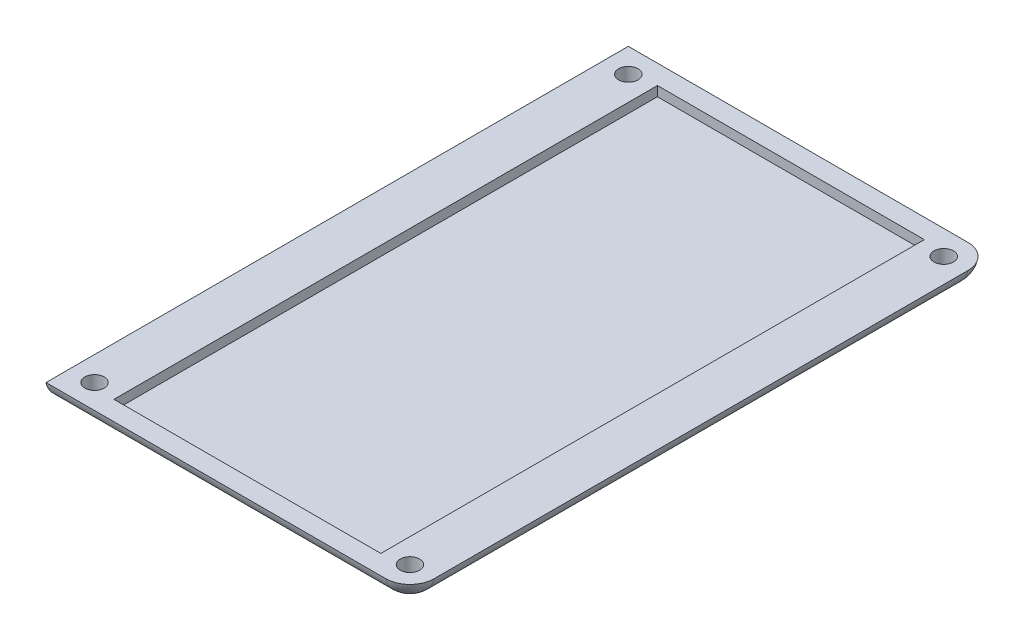
ISO-10303-21;
HEADER;
FILE_DESCRIPTION(('STEP AP214'),'2;1');
FILE_NAME('part.step','',(''),(''),'','','');
FILE_SCHEMA(('AUTOMOTIVE_DESIGN { 1 0 10303 214 1 1 1 1 }'));
ENDSEC;
DATA;
#1=APPLICATION_CONTEXT('core data for automotive mechanical design processes');
#2=APPLICATION_PROTOCOL_DEFINITION('international standard','automotive_design',2000,#1);
#3=PRODUCT_CONTEXT('',#1,'mechanical');
#4=PRODUCT('Part','Part','',(#3));
#5=PRODUCT_RELATED_PRODUCT_CATEGORY('part','',(#4));
#6=PRODUCT_DEFINITION_FORMATION('','',#4);
#7=PRODUCT_DEFINITION_CONTEXT('part definition',#1,'design');
#8=PRODUCT_DEFINITION('design','',#6,#7);
#9=PRODUCT_DEFINITION_SHAPE('','',#8);
#10=(LENGTH_UNIT() NAMED_UNIT(*) SI_UNIT(.MILLI.,.METRE.));
#11=(NAMED_UNIT(*) PLANE_ANGLE_UNIT() SI_UNIT($,.RADIAN.));
#12=(NAMED_UNIT(*) SI_UNIT($,.STERADIAN.) SOLID_ANGLE_UNIT());
#13=UNCERTAINTY_MEASURE_WITH_UNIT(LENGTH_MEASURE(1.E-05),#10,'distance_accuracy_value','');
#14=(GEOMETRIC_REPRESENTATION_CONTEXT(3) GLOBAL_UNCERTAINTY_ASSIGNED_CONTEXT((#13)) GLOBAL_UNIT_ASSIGNED_CONTEXT((#10,
#11,#12)) REPRESENTATION_CONTEXT('',''));
#15=CARTESIAN_POINT('',(0.,0.,0.));
#16=DIRECTION('',(0.,0.,1.));
#17=DIRECTION('',(1.,0.,0.));
#18=AXIS2_PLACEMENT_3D('',#15,#16,#17);
#19=CARTESIAN_POINT('',(0.,2.,0.));
#20=DIRECTION('',(1.,0.,0.));
#21=DIRECTION('',(0.,0.,-1.));
#22=AXIS2_PLACEMENT_3D('',#19,#20,#21);
#23=PLANE('',#22);
#24=DIRECTION('',(0.,0.,1.));
#25=VECTOR('',#24,1.);
#26=CARTESIAN_POINT('',(0.,0.,0.));
#27=LINE('',#26,#25);
#28=CARTESIAN_POINT('',(0.,0.,-57.5505102572168));
#29=VERTEX_POINT('',#28);
#30=CARTESIAN_POINT('',(0.,0.,-2.44948974278318));
#31=VERTEX_POINT('',#30);
#32=EDGE_CURVE('E198',#29,#31,#27,.T.);
#33=ORIENTED_EDGE('',*,*,#32,.T.);
#34=CARTESIAN_POINT('',(0.,2.5,-2.44948974278318));
#35=DIRECTION('',(1.,0.,0.));
#36=DIRECTION('',(0.,0.,-1.));
#37=AXIS2_PLACEMENT_3D('',#34,#35,#36);
#38=CIRCLE('',#37,2.5);
#39=CARTESIAN_POINT('',(0.,2.,0.));
#40=VERTEX_POINT('',#39);
#41=EDGE_CURVE('E272',#31,#40,#38,.F.);
#42=ORIENTED_EDGE('',*,*,#41,.T.);
#43=DIRECTION('',(0.,0.,1.));
#44=VECTOR('',#43,1.);
#45=CARTESIAN_POINT('',(0.,2.,0.));
#46=LINE('',#45,#44);
#47=CARTESIAN_POINT('',(0.,2.,-60.));
#48=VERTEX_POINT('',#47);
#49=EDGE_CURVE('E201',#48,#40,#46,.T.);
#50=ORIENTED_EDGE('',*,*,#49,.F.);
#51=CARTESIAN_POINT('',(0.,2.5,-57.5505102572168));
#52=DIRECTION('',(1.,0.,0.));
#53=DIRECTION('',(0.,0.,-1.));
#54=AXIS2_PLACEMENT_3D('',#51,#52,#53);
#55=CIRCLE('',#54,2.5);
#56=EDGE_CURVE('E268',#48,#29,#55,.F.);
#57=ORIENTED_EDGE('',*,*,#56,.T.);
#58=EDGE_LOOP('',(#33,#42,#50,#57));
#59=FACE_BOUND('',#58,.T.);
#60=ADVANCED_FACE('F33',(#59),#23,.F.);
#61=CARTESIAN_POINT('',(0.,2.,0.));
#62=DIRECTION('',(0.,-1.,0.));
#63=DIRECTION('',(0.,0.,-1.));
#64=AXIS2_PLACEMENT_3D('',#61,#62,#63);
#65=PLANE('',#64);
#66=DIRECTION('',(1.,0.,0.));
#67=VECTOR('',#66,1.);
#68=CARTESIAN_POINT('',(5.00000000000001,2.,-2.));
#69=LINE('',#68,#67);
#70=CARTESIAN_POINT('',(5.00000000000001,2.,-2.));
#71=VERTEX_POINT('',#70);
#72=CARTESIAN_POINT('',(32.5,2.,-2.));
#73=VERTEX_POINT('',#72);
#74=EDGE_CURVE('E167',#71,#73,#69,.T.);
#75=ORIENTED_EDGE('',*,*,#74,.F.);
#76=DIRECTION('',(0.,0.,1.));
#77=VECTOR('',#76,1.);
#78=CARTESIAN_POINT('',(5.,2.,-58.));
#79=LINE('',#78,#77);
#80=CARTESIAN_POINT('',(5.,2.,-58.));
#81=VERTEX_POINT('',#80);
#82=EDGE_CURVE('E141',#81,#71,#79,.T.);
#83=ORIENTED_EDGE('',*,*,#82,.F.);
#84=DIRECTION('',(-1.,0.,0.));
#85=VECTOR('',#84,1.);
#86=CARTESIAN_POINT('',(5.,2.,-58.));
#87=LINE('',#86,#85);
#88=CARTESIAN_POINT('',(32.5,2.,-58.));
#89=VERTEX_POINT('',#88);
#90=EDGE_CURVE('E158',#89,#81,#87,.T.);
#91=ORIENTED_EDGE('',*,*,#90,.F.);
#92=DIRECTION('',(0.,0.,-1.));
#93=VECTOR('',#92,1.);
#94=CARTESIAN_POINT('',(32.5,2.,-58.));
#95=LINE('',#94,#93);
#96=EDGE_CURVE('E161',#73,#89,#95,.T.);
#97=ORIENTED_EDGE('',*,*,#96,.F.);
#98=EDGE_LOOP('',(#75,#83,#91,#97));
#99=FACE_BOUND('',#98,.T.);
#100=CARTESIAN_POINT('',(2.5,2.,-2.5));
#101=DIRECTION('',(0.,1.,0.));
#102=DIRECTION('',(0.,0.,1.));
#103=AXIS2_PLACEMENT_3D('',#100,#101,#102);
#104=CIRCLE('',#103,1.);
#105=CARTESIAN_POINT('',(2.5,2.,-1.5));
#106=VERTEX_POINT('',#105);
#107=EDGE_CURVE('E173',#106,#106,#104,.T.);
#108=ORIENTED_EDGE('',*,*,#107,.F.);
#109=EDGE_LOOP('',(#108));
#110=FACE_BOUND('',#109,.T.);
#111=CARTESIAN_POINT('',(35.,2.,-2.5));
#112=DIRECTION('',(0.,1.,0.));
#113=DIRECTION('',(0.,0.,1.));
#114=AXIS2_PLACEMENT_3D('',#111,#112,#113);
#115=CIRCLE('',#114,0.999999999999998);
#116=CARTESIAN_POINT('',(35.,2.,-1.5));
#117=VERTEX_POINT('',#116);
#118=EDGE_CURVE('E187',#117,#117,#115,.T.);
#119=ORIENTED_EDGE('',*,*,#118,.F.);
#120=EDGE_LOOP('',(#119));
#121=FACE_BOUND('',#120,.T.);
#122=CARTESIAN_POINT('',(35.,2.,-57.5));
#123=DIRECTION('',(0.,1.,0.));
#124=DIRECTION('',(0.,0.,1.));
#125=AXIS2_PLACEMENT_3D('',#122,#123,#124);
#126=CIRCLE('',#125,0.999999999999998);
#127=CARTESIAN_POINT('',(35.,2.,-56.5));
#128=VERTEX_POINT('',#127);
#129=EDGE_CURVE('E181',#128,#128,#126,.T.);
#130=ORIENTED_EDGE('',*,*,#129,.F.);
#131=EDGE_LOOP('',(#130));
#132=FACE_BOUND('',#131,.T.);
#133=CARTESIAN_POINT('',(2.5,2.,-57.5));
#134=DIRECTION('',(0.,1.,0.));
#135=DIRECTION('',(0.,0.,1.));
#136=AXIS2_PLACEMENT_3D('',#133,#134,#135);
#137=CIRCLE('',#136,1.);
#138=CARTESIAN_POINT('',(2.5,2.,-56.5));
#139=VERTEX_POINT('',#138);
#140=EDGE_CURVE('E180',#139,#139,#137,.T.);
#141=ORIENTED_EDGE('',*,*,#140,.F.);
#142=EDGE_LOOP('',(#141));
#143=FACE_BOUND('',#142,.T.);
#144=DIRECTION('',(1.,0.,0.));
#145=VECTOR('',#144,1.);
#146=CARTESIAN_POINT('',(0.,2.,0.));
#147=LINE('',#146,#145);
#148=CARTESIAN_POINT('',(35.,2.,0.));
#149=VERTEX_POINT('',#148);
#150=EDGE_CURVE('E204',#40,#149,#147,.T.);
#151=ORIENTED_EDGE('',*,*,#150,.T.);
#152=CARTESIAN_POINT('',(35.,2.,-2.5));
#153=DIRECTION('',(0.,-1.,0.));
#154=DIRECTION('',(0.,0.,-1.));
#155=AXIS2_PLACEMENT_3D('',#152,#153,#154);
#156=CIRCLE('',#155,2.5);
#157=CARTESIAN_POINT('',(37.5,2.,-2.5));
#158=VERTEX_POINT('',#157);
#159=EDGE_CURVE('E215',#149,#158,#156,.F.);
#160=ORIENTED_EDGE('',*,*,#159,.T.);
#161=DIRECTION('',(0.,0.,-1.));
#162=VECTOR('',#161,1.);
#163=CARTESIAN_POINT('',(37.5,2.,0.));
#164=LINE('',#163,#162);
#165=CARTESIAN_POINT('',(37.5,2.,-57.5));
#166=VERTEX_POINT('',#165);
#167=EDGE_CURVE('E207',#158,#166,#164,.T.);
#168=ORIENTED_EDGE('',*,*,#167,.T.);
#169=CARTESIAN_POINT('',(35.,2.,-57.5));
#170=DIRECTION('',(0.,-1.,0.));
#171=DIRECTION('',(0.,0.,-1.));
#172=AXIS2_PLACEMENT_3D('',#169,#170,#171);
#173=CIRCLE('',#172,2.5);
#174=CARTESIAN_POINT('',(35.,2.,-60.));
#175=VERTEX_POINT('',#174);
#176=EDGE_CURVE('E211',#166,#175,#173,.F.);
#177=ORIENTED_EDGE('',*,*,#176,.T.);
#178=DIRECTION('',(-1.,0.,0.));
#179=VECTOR('',#178,1.);
#180=CARTESIAN_POINT('',(0.,2.,-60.));
#181=LINE('',#180,#179);
#182=EDGE_CURVE('E209',#175,#48,#181,.T.);
#183=ORIENTED_EDGE('',*,*,#182,.T.);
#184=ORIENTED_EDGE('',*,*,#49,.T.);
#185=EDGE_LOOP('',(#151,#160,#168,#177,#183,#184));
#186=FACE_BOUND('',#185,.T.);
#187=ADVANCED_FACE('F292',(#99,#110,#121,#132,#143,#186),#65,.F.);
#188=CARTESIAN_POINT('',(0.,0.,0.));
#189=DIRECTION('',(0.,-1.,0.));
#190=DIRECTION('',(0.,0.,-1.));
#191=AXIS2_PLACEMENT_3D('',#188,#189,#190);
#192=PLANE('',#191);
#193=CARTESIAN_POINT('',(35.,0.,-2.5));
#194=DIRECTION('',(0.,1.,0.));
#195=DIRECTION('',(0.,0.,1.));
#196=AXIS2_PLACEMENT_3D('',#193,#194,#195);
#197=CIRCLE('',#196,0.999999999999998);
#198=CARTESIAN_POINT('',(35.0505102572168,0.,-3.4987235422858));
#199=VERTEX_POINT('',#198);
#200=CARTESIAN_POINT('',(34.0012764577142,0.,-2.44948974278318));
#201=VERTEX_POINT('',#200);
#202=EDGE_CURVE('E184',#199,#201,#197,.T.);
#203=ORIENTED_EDGE('',*,*,#202,.T.);
#204=DIRECTION('',(1.,0.,0.));
#205=VECTOR('',#204,1.);
#206=CARTESIAN_POINT('',(0.,0.,-2.44948974278318));
#207=LINE('',#206,#205);
#208=CARTESIAN_POINT('',(3.4987235422858,0.,-2.44948974278318));
#209=VERTEX_POINT('',#208);
#210=EDGE_CURVE('E269',#201,#209,#207,.F.);
#211=ORIENTED_EDGE('',*,*,#210,.T.);
#212=CARTESIAN_POINT('',(2.5,0.,-2.5));
#213=DIRECTION('',(0.,1.,0.));
#214=DIRECTION('',(0.,0.,1.));
#215=AXIS2_PLACEMENT_3D('',#212,#213,#214);
#216=CIRCLE('',#215,1.);
#217=CARTESIAN_POINT('',(1.5012764577142,0.,-2.44948974278318));
#218=VERTEX_POINT('',#217);
#219=EDGE_CURVE('E190',#209,#218,#216,.T.);
#220=ORIENTED_EDGE('',*,*,#219,.T.);
#221=DIRECTION('',(1.,0.,0.));
#222=VECTOR('',#221,1.);
#223=CARTESIAN_POINT('',(0.,0.,-2.44948974278318));
#224=LINE('',#223,#222);
#225=EDGE_CURVE('E312',#218,#31,#224,.F.);
#226=ORIENTED_EDGE('',*,*,#225,.T.);
#227=ORIENTED_EDGE('',*,*,#32,.F.);
#228=DIRECTION('',(-1.,0.,0.));
#229=VECTOR('',#228,1.);
#230=CARTESIAN_POINT('',(35.,0.,-57.5505102572168));
#231=LINE('',#230,#229);
#232=CARTESIAN_POINT('',(1.5012764577142,0.,-57.5505102572168));
#233=VERTEX_POINT('',#232);
#234=EDGE_CURVE('E323',#29,#233,#231,.F.);
#235=ORIENTED_EDGE('',*,*,#234,.T.);
#236=CARTESIAN_POINT('',(2.5,0.,-57.5));
#237=DIRECTION('',(0.,1.,0.));
#238=DIRECTION('',(0.,0.,1.));
#239=AXIS2_PLACEMENT_3D('',#236,#237,#238);
#240=CIRCLE('',#239,1.);
#241=CARTESIAN_POINT('',(3.4987235422858,0.,-57.5505102572168));
#242=VERTEX_POINT('',#241);
#243=EDGE_CURVE('E195',#233,#242,#240,.T.);
#244=ORIENTED_EDGE('',*,*,#243,.T.);
#245=DIRECTION('',(-1.,0.,0.));
#246=VECTOR('',#245,1.);
#247=CARTESIAN_POINT('',(35.,0.,-57.5505102572168));
#248=LINE('',#247,#246);
#249=CARTESIAN_POINT('',(34.0012764577142,0.,-57.5505102572168));
#250=VERTEX_POINT('',#249);
#251=EDGE_CURVE('E326',#242,#250,#248,.F.);
#252=ORIENTED_EDGE('',*,*,#251,.T.);
#253=CARTESIAN_POINT('',(35.,0.,-57.5));
#254=DIRECTION('',(0.,1.,0.));
#255=DIRECTION('',(0.,0.,1.));
#256=AXIS2_PLACEMENT_3D('',#253,#254,#255);
#257=CIRCLE('',#256,0.999999999999998);
#258=CARTESIAN_POINT('',(35.0505102572168,0.,-56.5012764577142));
#259=VERTEX_POINT('',#258);
#260=EDGE_CURVE('E177',#250,#259,#257,.T.);
#261=ORIENTED_EDGE('',*,*,#260,.T.);
#262=DIRECTION('',(0.,0.,-1.));
#263=VECTOR('',#262,1.);
#264=CARTESIAN_POINT('',(35.0505102572168,0.,-2.5));
#265=LINE('',#264,#263);
#266=EDGE_CURVE('E250',#259,#199,#265,.F.);
#267=ORIENTED_EDGE('',*,*,#266,.T.);
#268=EDGE_LOOP('',(#203,#211,#220,#226,#227,#235,#244,#252,#261,#267));
#269=FACE_BOUND('',#268,.T.);
#270=ADVANCED_FACE('F290',(#269),#192,.T.);
#271=CARTESIAN_POINT('',(2.5,0.,-57.5));
#272=DIRECTION('',(0.,1.,0.));
#273=DIRECTION('',(0.,0.,1.));
#274=AXIS2_PLACEMENT_3D('',#271,#272,#273);
#275=CYLINDRICAL_SURFACE('',#274,1.);
#276=ORIENTED_EDGE('',*,*,#243,.F.);
#277=CARTESIAN_POINT('',(1.5012764577142,0.,-57.5505102572168));
#278=CARTESIAN_POINT('',(1.50264405103061,-2.33867517916646E-06,-57.5775696890232));
#279=CARTESIAN_POINT('',(1.50511321347047,0.000439812273468856,-57.604559137011));
#280=CARTESIAN_POINT('',(1.5122243588701,0.00217726214721237,-57.6582139549573));
#281=CARTESIAN_POINT('',(1.51686564895951,0.00347228907353855,-57.684879425478));
#282=CARTESIAN_POINT('',(1.53395602142734,0.00856891273167531,-57.7639149393168));
#283=CARTESIAN_POINT('',(1.54958381992474,0.0135826689881734,-57.815557246347));
#284=CARTESIAN_POINT('',(1.58874160063682,0.0262467316347284,-57.9153105617559));
#285=CARTESIAN_POINT('',(1.61226554541273,0.0338950237602736,-57.9634242340044));
#286=CARTESIAN_POINT('',(1.6665067107986,0.0510056023855132,-58.0550918710336));
#287=CARTESIAN_POINT('',(1.6972292848779,0.0604692379635587,-58.0986424072526));
#288=CARTESIAN_POINT('',(1.76651267404628,0.0806611391987383,-58.1819497876315));
#289=CARTESIAN_POINT('',(1.8053510851303,0.0914260547196431,-58.2214667892024));
#290=CARTESIAN_POINT('',(1.88905910225778,0.112693859589415,-58.2936025958969));
#291=CARTESIAN_POINT('',(1.93393041329925,0.123196673865595,-58.3262194441914));
#292=CARTESIAN_POINT('',(2.03033494452181,0.143071658891476,-58.3847034912981));
#293=CARTESIAN_POINT('',(2.08204459013178,0.152392322691949,-58.4102990109523));
#294=CARTESIAN_POINT('',(2.1894678908045,0.168204722239597,-58.4523082850072));
#295=CARTESIAN_POINT('',(2.24517935815632,0.174697990157419,-58.4687270136981));
#296=CARTESIAN_POINT('',(2.35606494412164,0.18366842159323,-58.4911205114653));
#297=CARTESIAN_POINT('',(2.41112660135217,0.186330190700132,-58.4975765193841));
#298=CARTESIAN_POINT('',(2.52160427875832,0.187853836380068,-58.5012918771889));
#299=CARTESIAN_POINT('',(2.57702018579643,0.186716871033467,-58.4985540299078));
#300=CARTESIAN_POINT('',(2.68343125593536,0.180976667075142,-58.4844169352516));
#301=CARTESIAN_POINT('',(2.73450234364879,0.17656661172096,-58.4735000980935));
#302=CARTESIAN_POINT('',(2.83405101899508,0.165058313288944,-58.4439844714306));
#303=CARTESIAN_POINT('',(2.88252807700792,0.157959523627276,-58.4253841199001));
#304=CARTESIAN_POINT('',(2.97730922040125,0.14162078319076,-58.3803519541813));
#305=CARTESIAN_POINT('',(3.02348909786234,0.132317995561402,-58.3536823162894));
#306=CARTESIAN_POINT('',(3.1109081403264,0.11274285988141,-58.2934797604795));
#307=CARTESIAN_POINT('',(3.15214574268316,0.102470207004991,-58.2599446808782));
#308=CARTESIAN_POINT('',(3.23137592450108,0.0813362654987416,-58.1843129658374));
#309=CARTESIAN_POINT('',(3.26896909652313,0.0704813723528512,-58.1417947010422));
#310=CARTESIAN_POINT('',(3.33657415075004,0.050121872570814,-58.0507785169673));
#311=CARTESIAN_POINT('',(3.36658285516127,0.0406178326521034,-58.0022781038673));
#312=CARTESIAN_POINT('',(3.41803192545553,0.0240950580371556,-57.9005785210998));
#313=CARTESIAN_POINT('',(3.43947983557512,0.0170741357073795,-57.847383539256));
#314=CARTESIAN_POINT('',(3.47297005924028,0.00643039932496516,-57.7378817658043));
#315=CARTESIAN_POINT('',(3.48503553558208,0.00279921241867207,-57.6815830073408));
#316=CARTESIAN_POINT('',(3.49529830178922,0.000364829666811141,-57.6000379559803));
#317=CARTESIAN_POINT('',(3.49747997310056,-8.5960145487677E-06,-57.575291076056));
#318=CARTESIAN_POINT('',(3.4987235422858,0.,-57.5505102572168));
#319=B_SPLINE_CURVE_WITH_KNOTS('',3,(#277,#278,#279,#280,#281,#282,#283,#284,#285,#286,#287,
#288,#289,#290,#291,#292,#293,#294,#295,#296,#297,#298,#299,#300,#301,#302,#303,#304,#305,#306,
#307,#308,#309,#310,#311,#312,#313,#314,#315,#316,#317,#318),.UNSPECIFIED.,.F.,.F.,(4,2,2,2,2,2,
2,2,2,2,2,2,2,2,2,2,2,2,2,2,4),(0.,0.0812282793773252,0.162430666010074,0.324144430400525,
0.485734828110469,0.647445780768329,0.816028316650593,0.984658597310153,1.15910651111915,
1.3334597733007,1.49909363549077,1.66467700722895,1.8211948428495,1.97774451355124,
2.13945181946962,2.30121011979135,2.47374850165285,2.64635905546346,2.81881715784854,
2.9908481421979,3.06530226582272),.UNSPECIFIED.);
#320=EDGE_CURVE('E274',#233,#242,#319,.T.);
#321=ORIENTED_EDGE('',*,*,#320,.T.);
#322=EDGE_LOOP('',(#276,#321));
#323=FACE_BOUND('',#322,.T.);
#324=ORIENTED_EDGE('',*,*,#140,.T.);
#325=EDGE_LOOP('',(#324));
#326=FACE_BOUND('',#325,.T.);
#327=ADVANCED_FACE('F286',(#323,#326),#275,.F.);
#328=CARTESIAN_POINT('',(35.,0.,-57.5));
#329=DIRECTION('',(0.,1.,0.));
#330=DIRECTION('',(0.,0.,1.));
#331=AXIS2_PLACEMENT_3D('',#328,#329,#330);
#332=CYLINDRICAL_SURFACE('',#331,0.999999999999998);
#333=ORIENTED_EDGE('',*,*,#260,.F.);
#334=CARTESIAN_POINT('',(34.0012764577142,0.,-57.5505102572168));
#335=CARTESIAN_POINT('',(34.0026441319347,-2.3397855225092E-06,-57.5775713194325));
#336=CARTESIAN_POINT('',(34.0051135105562,0.000439865117102175,-57.6045623911236));
#337=CARTESIAN_POINT('',(34.0122253472611,0.00217752324264487,-57.6582203997789));
#338=CARTESIAN_POINT('',(34.0168671119001,0.00347270424185821,-57.6848874373929));
#339=CARTESIAN_POINT('',(34.0339579068886,0.00856951633223681,-57.7639211832526));
#340=CARTESIAN_POINT('',(34.0495849990542,0.0135830515313766,-57.8155602609504));
#341=CARTESIAN_POINT('',(34.088740719633,0.0262464455095745,-57.915308306627));
#342=CARTESIAN_POINT('',(34.1122634313744,0.0338943303210462,-57.9634198851808));
#343=CARTESIAN_POINT('',(34.1665039235759,0.0510047493196107,-58.055087937046));
#344=CARTESIAN_POINT('',(34.197227703972,0.0604687955354192,-58.0986405678234));
#345=CARTESIAN_POINT('',(34.2665150056715,0.0806617996375576,-58.1819525271233));
#346=CARTESIAN_POINT('',(34.3053562898721,0.0914274278891324,-58.221471874803));
#347=CARTESIAN_POINT('',(34.3890647043095,0.112695230687084,-58.2936068228169));
#348=CARTESIAN_POINT('',(34.4339327647072,0.12319736426868,-58.3262213554697));
#349=CARTESIAN_POINT('',(34.5303421956881,0.143072941041521,-58.3847073886212));
#350=CARTESIAN_POINT('',(34.5820611181613,0.15239456626824,-58.4103056016455));
#351=CARTESIAN_POINT('',(34.6894801033244,0.168206711406278,-58.4523129345077));
#352=CARTESIAN_POINT('',(34.7451769119042,0.174699515247532,-58.4687294704853));
#353=CARTESIAN_POINT('',(34.8559651146271,0.183658711852794,-58.49109755282));
#354=CARTESIAN_POINT('',(34.9109383887207,0.186316272135063,-58.4975471914704));
#355=CARTESIAN_POINT('',(34.9937150203053,0.187474850126824,-58.500365422818));
#356=CARTESIAN_POINT('',(35.02142427913,0.187386254165634,-58.5001536621187));
#357=CARTESIAN_POINT('',(35.076717834101,0.186273724507209,-58.4974369179302));
#358=CARTESIAN_POINT('',(35.1043021000363,0.185249575660375,-58.4949314069459));
#359=CARTESIAN_POINT('',(35.13172319026,0.18376599005516,-58.491286538367));
#360=B_SPLINE_CURVE_WITH_KNOTS('',3,(#334,#335,#336,#337,#338,#339,#340,#341,#342,#343,#344,
#345,#346,#347,#348,#349,#350,#351,#352,#353,#354,#355,#356,#357,#358,#359),.UNSPECIFIED.,.F.,
.F.,(4,2,2,2,2,2,2,2,2,2,2,2,4),(0.,0.0812331724296611,0.162440432191945,0.324144456676382,
0.485727575942325,0.647445808012202,0.816039191262506,0.984658624847755,1.15912977856925,
1.33345980578604,1.49875843686917,1.58179156718048,1.66484379747366),.UNSPECIFIED.);
#361=CARTESIAN_POINT('',(35.,0.187324227577601,-58.5));
#362=VERTEX_POINT('',#361);
#363=EDGE_CURVE('E11',#250,#362,#360,.T.);
#364=ORIENTED_EDGE('',*,*,#363,.T.);
#365=CARTESIAN_POINT('',(35.,0.187324227577601,-57.5));
#366=DIRECTION('',(0.,1.,0.));
#367=DIRECTION('',(0.,0.,1.));
#368=AXIS2_PLACEMENT_3D('',#365,#366,#367);
#369=CIRCLE('',#368,0.999999999999998);
#370=CARTESIAN_POINT('',(36.,0.187324227577607,-57.5));
#371=VERTEX_POINT('',#370);
#372=EDGE_CURVE('E43',#362,#371,#369,.F.);
#373=ORIENTED_EDGE('',*,*,#372,.T.);
#374=CARTESIAN_POINT('',(36.,0.187324227577607,-57.5));
#375=CARTESIAN_POINT('',(36.0000010400965,0.187327660908585,-57.4729452236148));
#376=CARTESIAN_POINT('',(35.9989013533235,0.186872876961852,-57.4459046002687));
#377=CARTESIAN_POINT('',(35.9945222823931,0.185081052657888,-57.3920392103276));
#378=CARTESIAN_POINT('',(35.9912436647546,0.183744322558788,-57.3652143711801));
#379=CARTESIAN_POINT('',(35.978211262959,0.178478273991485,-57.2855630065107));
#380=CARTESIAN_POINT('',(35.9652604508307,0.173292462295635,-57.2333055718759));
#381=CARTESIAN_POINT('',(35.9313330208901,0.160240162416273,-57.1319242380097));
#382=CARTESIAN_POINT('',(35.9103635544071,0.15237606350884,-57.0827975920411));
#383=CARTESIAN_POINT('',(35.861040504461,0.134894492584265,-56.9886941084544));
#384=CARTESIAN_POINT('',(35.832679872288,0.1252753494802,-56.9437212879552));
#385=CARTESIAN_POINT('',(35.767820986716,0.104865025528893,-56.8569442639027));
#386=CARTESIAN_POINT('',(35.7310051146387,0.0940401166531934,-56.8153853688209));
#387=CARTESIAN_POINT('',(35.6509503634194,0.072823672678367,-56.7388625581384));
#388=CARTESIAN_POINT('',(35.6077111837927,0.0624321578827133,-56.7038989512415));
#389=CARTESIAN_POINT('',(35.5143156980783,0.042923020624711,-56.6404867751155));
#390=CARTESIAN_POINT('',(35.4639833321231,0.0338563329379655,-56.6122803643532));
#391=CARTESIAN_POINT('',(35.3588838057641,0.0185242943999707,-56.5648401346026));
#392=CARTESIAN_POINT('',(35.3041196424529,0.0122570687491833,-56.5456003103167));
#393=CARTESIAN_POINT('',(35.1946562680881,0.00358806130158863,-56.5175899391199));
#394=CARTESIAN_POINT('',(35.1400979434222,0.00100441986107584,-56.5083328045099));
#395=CARTESIAN_POINT('',(35.057604115875,-0.000143222081517743,-56.5012752266121));
#396=CARTESIAN_POINT('',(35.0299376896282,-6.80707251156498E-05,-56.5000654353216));
#397=CARTESIAN_POINT('',(34.9746106299033,0.00099884570864685,-56.4999397365131));
#398=CARTESIAN_POINT('',(34.9469499993878,0.00199082975620889,-56.5010243770615));
#399=CARTESIAN_POINT('',(34.9193925553523,0.0034407380841612,-56.503254074567));
#400=B_SPLINE_CURVE_WITH_KNOTS('',3,(#374,#375,#376,#377,#378,#379,#380,#381,#382,#383,#384,
#385,#386,#387,#388,#389,#390,#391,#392,#393,#394,#395,#396,#397,#398,#399),.UNSPECIFIED.,.F.,
.F.,(4,2,2,2,2,2,2,2,2,2,2,2,4),(0.,0.081110725575419,0.162192932568754,0.323605505039074,
0.484874458344836,0.646297774908499,0.815243193080015,0.984196517069276,1.15851527961201,
1.33271712521902,1.49797940121284,1.58096158470671,1.66396359223435),.UNSPECIFIED.);
#401=EDGE_CURVE('E280',#371,#259,#400,.T.);
#402=ORIENTED_EDGE('',*,*,#401,.T.);
#403=EDGE_LOOP('',(#333,#364,#373,#402));
#404=FACE_BOUND('',#403,.T.);
#405=ORIENTED_EDGE('',*,*,#129,.T.);
#406=EDGE_LOOP('',(#405));
#407=FACE_BOUND('',#406,.T.);
#408=ADVANCED_FACE('F236',(#404,#407),#332,.F.);
#409=CARTESIAN_POINT('',(35.,0.,-2.5));
#410=DIRECTION('',(0.,1.,0.));
#411=DIRECTION('',(0.,0.,1.));
#412=AXIS2_PLACEMENT_3D('',#409,#410,#411);
#413=CYLINDRICAL_SURFACE('',#412,0.999999999999998);
#414=CARTESIAN_POINT('',(35.,0.187324227577601,-2.5));
#415=DIRECTION('',(0.,1.,0.));
#416=DIRECTION('',(0.,0.,1.));
#417=AXIS2_PLACEMENT_3D('',#414,#415,#416);
#418=CIRCLE('',#417,0.999999999999998);
#419=CARTESIAN_POINT('',(36.,0.187324227577602,-2.5));
#420=VERTEX_POINT('',#419);
#421=CARTESIAN_POINT('',(35.,0.187324227577601,-1.5));
#422=VERTEX_POINT('',#421);
#423=EDGE_CURVE('E225',#420,#422,#418,.F.);
#424=ORIENTED_EDGE('',*,*,#423,.T.);
#425=CARTESIAN_POINT('',(35.,0.187324227577601,-1.5));
#426=CARTESIAN_POINT('',(34.9729452236148,0.187327660908579,-1.49999895990352));
#427=CARTESIAN_POINT('',(34.9459046002687,0.186872876961845,-1.50109864667647));
#428=CARTESIAN_POINT('',(34.8920392103276,0.185081052657882,-1.50547771760685));
#429=CARTESIAN_POINT('',(34.8652143711801,0.183744322558782,-1.50875633524537));
#430=CARTESIAN_POINT('',(34.7855630065107,0.17847827399148,-1.52178873704096));
#431=CARTESIAN_POINT('',(34.7333055718759,0.17329246229563,-1.53473954916929));
#432=CARTESIAN_POINT('',(34.6319242380097,0.160240162416268,-1.56866697910988));
#433=CARTESIAN_POINT('',(34.5827975920411,0.152376063508835,-1.58963644559286));
#434=CARTESIAN_POINT('',(34.4886941084544,0.134894492584261,-1.63895949553905));
#435=CARTESIAN_POINT('',(34.4437212879552,0.125275349480196,-1.66732012771203));
#436=CARTESIAN_POINT('',(34.3569442639026,0.104865025528888,-1.73217901328404));
#437=CARTESIAN_POINT('',(34.3153853688209,0.0940401166531885,-1.76899488536128));
#438=CARTESIAN_POINT('',(34.2388625581384,0.0728236726783632,-1.84904963658059));
#439=CARTESIAN_POINT('',(34.2038989512415,0.0624321578827109,-1.8922888162073));
#440=CARTESIAN_POINT('',(34.1404867751155,0.0429230206247096,-1.98568430192171));
#441=CARTESIAN_POINT('',(34.1122803643532,0.0338563329379636,-2.0360166678769));
#442=CARTESIAN_POINT('',(34.0648401346026,0.0185242943999692,-2.14111619423593));
#443=CARTESIAN_POINT('',(34.0456003103167,0.0122570687491829,-2.19588035754705));
#444=CARTESIAN_POINT('',(34.0175899391199,0.00358806130158856,-2.30534373191186));
#445=CARTESIAN_POINT('',(34.0083328045099,0.00100441986107536,-2.3599020565778));
#446=CARTESIAN_POINT('',(34.0012752266121,-0.000143222081517768,-2.442395884125));
#447=CARTESIAN_POINT('',(34.0000654353216,-6.80707251154136E-05,-2.47006231037176));
#448=CARTESIAN_POINT('',(33.9999397365131,0.000998845708647349,-2.52538937009674));
#449=CARTESIAN_POINT('',(34.0010243770615,0.00199082975620952,-2.55305000061215));
#450=CARTESIAN_POINT('',(34.003254074567,0.00344073808416165,-2.58060744464774));
#451=B_SPLINE_CURVE_WITH_KNOTS('',3,(#425,#426,#427,#428,#429,#430,#431,#432,#433,#434,#435,
#436,#437,#438,#439,#440,#441,#442,#443,#444,#445,#446,#447,#448,#449,#450),.UNSPECIFIED.,.F.,
.F.,(4,2,2,2,2,2,2,2,2,2,2,2,4),(0.,0.0811107255754119,0.162192932568753,0.323605505039073,
0.484874458344844,0.646297774908504,0.815243193080024,0.984196517069283,1.15851527961201,
1.33271712521902,1.49797940121284,1.58096158470671,1.66396359223435),.UNSPECIFIED.);
#452=EDGE_CURVE('E243',#422,#201,#451,.T.);
#453=ORIENTED_EDGE('',*,*,#452,.T.);
#454=ORIENTED_EDGE('',*,*,#202,.F.);
#455=CARTESIAN_POINT('',(35.0505102572168,0.,-3.4987235422858));
#456=CARTESIAN_POINT('',(35.0775713194325,-2.33978552262194E-06,-3.49735586806534));
#457=CARTESIAN_POINT('',(35.1045623911236,0.000439865117102022,-3.49488648944384));
#458=CARTESIAN_POINT('',(35.1582203997789,0.00217752324264471,-3.48777465273885));
#459=CARTESIAN_POINT('',(35.1848874373929,0.00347270424185808,-3.48313288809986));
#460=CARTESIAN_POINT('',(35.2639211832526,0.00856951633223679,-3.46604209311143));
#461=CARTESIAN_POINT('',(35.3155602609504,0.0135830515313767,-3.45041500094583));
#462=CARTESIAN_POINT('',(35.415308306627,0.0262464455095746,-3.41125928036697));
#463=CARTESIAN_POINT('',(35.4634198851808,0.0338943303210463,-3.38773656862562));
#464=CARTESIAN_POINT('',(35.555087937046,0.051004749319611,-3.33349607642405));
#465=CARTESIAN_POINT('',(35.5986405678234,0.0604687955354197,-3.30277229602803));
#466=CARTESIAN_POINT('',(35.6819525271233,0.0806617996375581,-3.23348499432849));
#467=CARTESIAN_POINT('',(35.721471874803,0.0914274278891328,-3.19464371012792));
#468=CARTESIAN_POINT('',(35.7936068228169,0.112695230687084,-3.11093529569049));
#469=CARTESIAN_POINT('',(35.8262213554697,0.123197364268681,-3.06606723529278));
#470=CARTESIAN_POINT('',(35.8847073886212,0.143072941041522,-2.96965780431192));
#471=CARTESIAN_POINT('',(35.9103056016455,0.152394566268241,-2.91793888183869));
#472=CARTESIAN_POINT('',(35.9523129345077,0.168206711406279,-2.81051989667555));
#473=CARTESIAN_POINT('',(35.9687294704853,0.174699515247532,-2.75482308809582));
#474=CARTESIAN_POINT('',(35.99109755282,0.183658711852794,-2.64403488537294));
#475=CARTESIAN_POINT('',(35.9975471914704,0.186316272135063,-2.58906161127934));
#476=CARTESIAN_POINT('',(36.000365422818,0.187474850126824,-2.50628497969469));
#477=CARTESIAN_POINT('',(36.0001536621187,0.187386254165634,-2.47857572087004));
#478=CARTESIAN_POINT('',(35.9974369179302,0.186273724507209,-2.42328216589895));
#479=CARTESIAN_POINT('',(35.9949314069459,0.185249575660375,-2.39569789996367));
#480=CARTESIAN_POINT('',(35.991286538367,0.18376599005516,-2.36827680973999));
#481=B_SPLINE_CURVE_WITH_KNOTS('',3,(#455,#456,#457,#458,#459,#460,#461,#462,#463,#464,#465,
#466,#467,#468,#469,#470,#471,#472,#473,#474,#475,#476,#477,#478,#479,#480),.UNSPECIFIED.,.F.,
.F.,(4,2,2,2,2,2,2,2,2,2,2,2,4),(0.,0.0812331724296616,0.162440432191945,0.324144456676382,
0.485727575942325,0.647445808012201,0.816039191262515,0.984658624847758,1.15912977856926,
1.33345980578604,1.49875843686916,1.58179156718048,1.66484379747366),.UNSPECIFIED.);
#482=EDGE_CURVE('E217',#199,#420,#481,.T.);
#483=ORIENTED_EDGE('',*,*,#482,.T.);
#484=EDGE_LOOP('',(#424,#453,#454,#483));
#485=FACE_BOUND('',#484,.T.);
#486=ORIENTED_EDGE('',*,*,#118,.T.);
#487=EDGE_LOOP('',(#486));
#488=FACE_BOUND('',#487,.T.);
#489=ADVANCED_FACE('F230',(#485,#488),#413,.F.);
#490=CARTESIAN_POINT('',(2.5,0.,-2.5));
#491=DIRECTION('',(0.,1.,0.));
#492=DIRECTION('',(0.,0.,1.));
#493=AXIS2_PLACEMENT_3D('',#490,#491,#492);
#494=CYLINDRICAL_SURFACE('',#493,1.);
#495=ORIENTED_EDGE('',*,*,#219,.F.);
#496=CARTESIAN_POINT('',(3.4987235422858,0.,-2.44948974278318));
#497=CARTESIAN_POINT('',(3.4973559489694,-2.33867517934177E-06,-2.42243031097681));
#498=CARTESIAN_POINT('',(3.49488678652953,0.000439812273468641,-2.39544086298899));
#499=CARTESIAN_POINT('',(3.4877756411299,0.00217726214721217,-2.34178604504274));
#500=CARTESIAN_POINT('',(3.48313435104049,0.00347228907353852,-2.31512057452196));
#501=CARTESIAN_POINT('',(3.46604397857267,0.00856891273167543,-2.23608506068318));
#502=CARTESIAN_POINT('',(3.45041618007526,0.0135826689881732,-2.18444275365305));
#503=CARTESIAN_POINT('',(3.41125839936318,0.026246731634728,-2.08468943824408));
#504=CARTESIAN_POINT('',(3.38773445458726,0.0338950237602733,-2.03657576599559));
#505=CARTESIAN_POINT('',(3.3334932892014,0.0510056023855129,-1.94490812896637));
#506=CARTESIAN_POINT('',(3.3027707151221,0.0604692379635581,-1.90135759274738));
#507=CARTESIAN_POINT('',(3.23348732595373,0.0806611391987366,-1.81805021236852));
#508=CARTESIAN_POINT('',(3.19464891486971,0.0914260547196405,-1.77853321079762));
#509=CARTESIAN_POINT('',(3.11094089774223,0.112693859589411,-1.70639740410315));
#510=CARTESIAN_POINT('',(3.06606958670075,0.123196673865592,-1.67378055580861));
#511=CARTESIAN_POINT('',(2.96966505547819,0.143071658891473,-1.61529650870188));
#512=CARTESIAN_POINT('',(2.91795540986822,0.152392322691947,-1.58970098904773));
#513=CARTESIAN_POINT('',(2.81053210919551,0.168204722239596,-1.54769171499283));
#514=CARTESIAN_POINT('',(2.75482064184369,0.174697990157417,-1.53127298630192));
#515=CARTESIAN_POINT('',(2.64393505587837,0.183668421593228,-1.5088794885347));
#516=CARTESIAN_POINT('',(2.58887339864784,0.18633019070013,-1.50242348061589));
#517=CARTESIAN_POINT('',(2.47839572124168,0.187853836380066,-1.49870812281112));
#518=CARTESIAN_POINT('',(2.42297981420357,0.186716871033466,-1.50144597009216));
#519=CARTESIAN_POINT('',(2.31656874406465,0.180976667075141,-1.51558306474838));
#520=CARTESIAN_POINT('',(2.26549765635121,0.176566611720958,-1.52649990190651));
#521=CARTESIAN_POINT('',(2.16594898100492,0.165058313288943,-1.55601552856939));
#522=CARTESIAN_POINT('',(2.11747192299208,0.157959523627276,-1.57461588009989));
#523=CARTESIAN_POINT('',(2.02269077959875,0.141620783190759,-1.61964804581871));
#524=CARTESIAN_POINT('',(1.97651090213766,0.132317995561402,-1.64631768371063));
#525=CARTESIAN_POINT('',(1.88909185967361,0.112742859881409,-1.70652023952047));
#526=CARTESIAN_POINT('',(1.84785425731684,0.102470207004991,-1.74005531912176));
#527=CARTESIAN_POINT('',(1.76862407549892,0.0813362654987415,-1.81568703416261));
#528=CARTESIAN_POINT('',(1.73103090347687,0.0704813723528503,-1.85820529895784));
#529=CARTESIAN_POINT('',(1.66342584924997,0.0501218725708129,-1.9492214830327));
#530=CARTESIAN_POINT('',(1.63341714483873,0.0406178326521033,-1.9977218961327));
#531=CARTESIAN_POINT('',(1.58196807454448,0.024095058037156,-2.09942147890017));
#532=CARTESIAN_POINT('',(1.56052016442489,0.0170741357073796,-2.15261646074402));
#533=CARTESIAN_POINT('',(1.52702994075972,0.00643039932496509,-2.26211823419575));
#534=CARTESIAN_POINT('',(1.51496446441792,0.00279921241867215,-2.31841699265918));
#535=CARTESIAN_POINT('',(1.50470169821079,0.00036482966681116,-2.39996204401966));
#536=CARTESIAN_POINT('',(1.50252002689944,-8.59601454878931E-06,-2.42470892394398));
#537=CARTESIAN_POINT('',(1.5012764577142,0.,-2.44948974278318));
#538=B_SPLINE_CURVE_WITH_KNOTS('',3,(#496,#497,#498,#499,#500,#501,#502,#503,#504,#505,#506,
#507,#508,#509,#510,#511,#512,#513,#514,#515,#516,#517,#518,#519,#520,#521,#522,#523,#524,#525,
#526,#527,#528,#529,#530,#531,#532,#533,#534,#535,#536,#537),.UNSPECIFIED.,.F.,.F.,(4,2,2,2,2,2,
2,2,2,2,2,2,2,2,2,2,2,2,2,2,4),(0.,0.0812282793773196,0.162430666010072,0.324144430400524,
0.485734828110475,0.647445780768325,0.816028316650577,0.984658597310147,1.15910651111915,
1.33345977330069,1.49909363549076,1.66467700722894,1.82119484284949,1.97774451355123,
2.13945181946961,2.30121011979134,2.47374850165284,2.64635905546345,2.81881715784853,
2.99084814219789,3.06530226582271),.UNSPECIFIED.);
#539=EDGE_CURVE('E261',#209,#218,#538,.T.);
#540=ORIENTED_EDGE('',*,*,#539,.T.);
#541=EDGE_LOOP('',(#495,#540));
#542=FACE_BOUND('',#541,.T.);
#543=ORIENTED_EDGE('',*,*,#107,.T.);
#544=EDGE_LOOP('',(#543));
#545=FACE_BOUND('',#544,.T.);
#546=ADVANCED_FACE('F235',(#542,#545),#494,.F.);
#547=CARTESIAN_POINT('',(5.,1.,-58.));
#548=DIRECTION('',(-1.,0.,0.));
#549=DIRECTION('',(0.,0.,1.));
#550=AXIS2_PLACEMENT_3D('',#547,#548,#549);
#551=PLANE('',#550);
#552=ORIENTED_EDGE('',*,*,#82,.T.);
#553=DIRECTION('',(0.,1.,0.));
#554=VECTOR('',#553,1.);
#555=CARTESIAN_POINT('',(5.00000000000001,1.,-2.));
#556=LINE('',#555,#554);
#557=CARTESIAN_POINT('',(5.00000000000001,1.,-2.));
#558=VERTEX_POINT('',#557);
#559=EDGE_CURVE('E134',#558,#71,#556,.T.);
#560=ORIENTED_EDGE('',*,*,#559,.F.);
#561=DIRECTION('',(0.,0.,1.));
#562=VECTOR('',#561,1.);
#563=CARTESIAN_POINT('',(5.,1.,-58.));
#564=LINE('',#563,#562);
#565=CARTESIAN_POINT('',(5.,1.,-58.));
#566=VERTEX_POINT('',#565);
#567=EDGE_CURVE('E138',#566,#558,#564,.T.);
#568=ORIENTED_EDGE('',*,*,#567,.F.);
#569=DIRECTION('',(0.,1.,0.));
#570=VECTOR('',#569,1.);
#571=CARTESIAN_POINT('',(5.,1.,-58.));
#572=LINE('',#571,#570);
#573=EDGE_CURVE('E171',#566,#81,#572,.T.);
#574=ORIENTED_EDGE('',*,*,#573,.T.);
#575=EDGE_LOOP('',(#552,#560,#568,#574));
#576=FACE_BOUND('',#575,.T.);
#577=ADVANCED_FACE('F136',(#576),#551,.F.);
#578=CARTESIAN_POINT('',(5.,1.,-58.));
#579=DIRECTION('',(0.,0.,-1.));
#580=DIRECTION('',(-1.,0.,0.));
#581=AXIS2_PLACEMENT_3D('',#578,#579,#580);
#582=PLANE('',#581);
#583=ORIENTED_EDGE('',*,*,#90,.T.);
#584=ORIENTED_EDGE('',*,*,#573,.F.);
#585=DIRECTION('',(-1.,0.,0.));
#586=VECTOR('',#585,1.);
#587=CARTESIAN_POINT('',(5.,1.,-58.));
#588=LINE('',#587,#586);
#589=CARTESIAN_POINT('',(32.5,1.,-58.));
#590=VERTEX_POINT('',#589);
#591=EDGE_CURVE('E146',#590,#566,#588,.T.);
#592=ORIENTED_EDGE('',*,*,#591,.F.);
#593=DIRECTION('',(0.,1.,0.));
#594=VECTOR('',#593,1.);
#595=CARTESIAN_POINT('',(32.5,1.,-58.));
#596=LINE('',#595,#594);
#597=EDGE_CURVE('E174',#590,#89,#596,.T.);
#598=ORIENTED_EDGE('',*,*,#597,.T.);
#599=EDGE_LOOP('',(#583,#584,#592,#598));
#600=FACE_BOUND('',#599,.T.);
#601=ADVANCED_FACE('F382',(#600),#582,.F.);
#602=CARTESIAN_POINT('',(32.5,1.,-58.));
#603=DIRECTION('',(1.,0.,0.));
#604=DIRECTION('',(0.,0.,-1.));
#605=AXIS2_PLACEMENT_3D('',#602,#603,#604);
#606=PLANE('',#605);
#607=ORIENTED_EDGE('',*,*,#96,.T.);
#608=ORIENTED_EDGE('',*,*,#597,.F.);
#609=DIRECTION('',(0.,0.,-1.));
#610=VECTOR('',#609,1.);
#611=CARTESIAN_POINT('',(32.5,1.,-58.));
#612=LINE('',#611,#610);
#613=CARTESIAN_POINT('',(32.5,1.,-2.));
#614=VERTEX_POINT('',#613);
#615=EDGE_CURVE('E154',#614,#590,#612,.T.);
#616=ORIENTED_EDGE('',*,*,#615,.F.);
#617=DIRECTION('',(0.,1.,0.));
#618=VECTOR('',#617,1.);
#619=CARTESIAN_POINT('',(32.5,1.,-2.));
#620=LINE('',#619,#618);
#621=EDGE_CURVE('E145',#614,#73,#620,.T.);
#622=ORIENTED_EDGE('',*,*,#621,.T.);
#623=EDGE_LOOP('',(#607,#608,#616,#622));
#624=FACE_BOUND('',#623,.T.);
#625=ADVANCED_FACE('F379',(#624),#606,.F.);
#626=CARTESIAN_POINT('',(5.00000000000001,1.,-2.));
#627=DIRECTION('',(0.,0.,1.));
#628=DIRECTION('',(1.,0.,0.));
#629=AXIS2_PLACEMENT_3D('',#626,#627,#628);
#630=PLANE('',#629);
#631=ORIENTED_EDGE('',*,*,#74,.T.);
#632=ORIENTED_EDGE('',*,*,#621,.F.);
#633=DIRECTION('',(1.,0.,0.));
#634=VECTOR('',#633,1.);
#635=CARTESIAN_POINT('',(5.00000000000001,1.,-2.));
#636=LINE('',#635,#634);
#637=EDGE_CURVE('E149',#558,#614,#636,.T.);
#638=ORIENTED_EDGE('',*,*,#637,.F.);
#639=ORIENTED_EDGE('',*,*,#559,.T.);
#640=EDGE_LOOP('',(#631,#632,#638,#639));
#641=FACE_BOUND('',#640,.T.);
#642=ADVANCED_FACE('F150',(#641),#630,.F.);
#643=CARTESIAN_POINT('',(0.,1.,0.));
#644=DIRECTION('',(0.,1.,0.));
#645=DIRECTION('',(0.,0.,1.));
#646=AXIS2_PLACEMENT_3D('',#643,#644,#645);
#647=PLANE('',#646);
#648=ORIENTED_EDGE('',*,*,#567,.T.);
#649=ORIENTED_EDGE('',*,*,#637,.T.);
#650=ORIENTED_EDGE('',*,*,#615,.T.);
#651=ORIENTED_EDGE('',*,*,#591,.T.);
#652=EDGE_LOOP('',(#648,#649,#650,#651));
#653=FACE_BOUND('',#652,.T.);
#654=ADVANCED_FACE('F156',(#653),#647,.T.);
#655=CARTESIAN_POINT('',(0.,2.5,-57.5505102572168));
#656=DIRECTION('',(1.,0.,0.));
#657=DIRECTION('',(0.,0.,-1.));
#658=AXIS2_PLACEMENT_3D('',#655,#656,#657);
#659=CYLINDRICAL_SURFACE('',#658,2.5);
#660=ORIENTED_EDGE('',*,*,#56,.F.);
#661=ORIENTED_EDGE('',*,*,#182,.F.);
#662=CARTESIAN_POINT('',(35.,2.5,-57.5505102572168));
#663=DIRECTION('',(1.,0.,0.));
#664=DIRECTION('',(0.,0.,-1.));
#665=AXIS2_PLACEMENT_3D('',#662,#663,#664);
#666=CIRCLE('',#665,2.5);
#667=EDGE_CURVE('E38',#362,#175,#666,.T.);
#668=ORIENTED_EDGE('',*,*,#667,.F.);
#669=ORIENTED_EDGE('',*,*,#363,.F.);
#670=ORIENTED_EDGE('',*,*,#251,.F.);
#671=ORIENTED_EDGE('',*,*,#320,.F.);
#672=ORIENTED_EDGE('',*,*,#234,.F.);
#673=EDGE_LOOP('',(#660,#661,#668,#669,#670,#671,#672));
#674=FACE_BOUND('',#673,.T.);
#675=ADVANCED_FACE('F35',(#674),#659,.T.);
#676=CARTESIAN_POINT('',(35.,2.5,-57.5));
#677=DIRECTION('',(0.,1.,0.));
#678=DIRECTION('',(0.,0.,1.));
#679=AXIS2_PLACEMENT_3D('',#676,#677,#678);
#680=DEGENERATE_TOROIDAL_SURFACE('',#679,0.0505102572168218,2.5,.T.);
#681=ORIENTED_EDGE('',*,*,#667,.T.);
#682=ORIENTED_EDGE('',*,*,#176,.F.);
#683=CARTESIAN_POINT('',(35.0505102572168,2.5,-57.5));
#684=DIRECTION('',(0.,0.,1.));
#685=DIRECTION('',(1.,0.,0.));
#686=AXIS2_PLACEMENT_3D('',#683,#684,#685);
#687=CIRCLE('',#686,2.5);
#688=EDGE_CURVE('E340',#371,#166,#687,.T.);
#689=ORIENTED_EDGE('',*,*,#688,.F.);
#690=ORIENTED_EDGE('',*,*,#372,.F.);
#691=EDGE_LOOP('',(#681,#682,#689,#690));
#692=FACE_BOUND('',#691,.T.);
#693=ADVANCED_FACE('F361',(#692),#680,.T.);
#694=CARTESIAN_POINT('',(35.0505102572168,2.5,0.));
#695=DIRECTION('',(0.,0.,1.));
#696=DIRECTION('',(1.,0.,0.));
#697=AXIS2_PLACEMENT_3D('',#694,#695,#696);
#698=CYLINDRICAL_SURFACE('',#697,2.5);
#699=ORIENTED_EDGE('',*,*,#688,.T.);
#700=ORIENTED_EDGE('',*,*,#167,.F.);
#701=CARTESIAN_POINT('',(35.0505102572168,2.5,-2.5));
#702=DIRECTION('',(0.,0.,1.));
#703=DIRECTION('',(1.,0.,0.));
#704=AXIS2_PLACEMENT_3D('',#701,#702,#703);
#705=CIRCLE('',#704,2.5);
#706=EDGE_CURVE('E337',#420,#158,#705,.T.);
#707=ORIENTED_EDGE('',*,*,#706,.F.);
#708=ORIENTED_EDGE('',*,*,#482,.F.);
#709=ORIENTED_EDGE('',*,*,#266,.F.);
#710=ORIENTED_EDGE('',*,*,#401,.F.);
#711=EDGE_LOOP('',(#699,#700,#707,#708,#709,#710));
#712=FACE_BOUND('',#711,.T.);
#713=ADVANCED_FACE('F227',(#712),#698,.T.);
#714=CARTESIAN_POINT('',(35.,2.5,-2.5));
#715=DIRECTION('',(0.,1.,0.));
#716=DIRECTION('',(0.,0.,1.));
#717=AXIS2_PLACEMENT_3D('',#714,#715,#716);
#718=DEGENERATE_TOROIDAL_SURFACE('',#717,0.0505102572168218,2.5,.T.);
#719=ORIENTED_EDGE('',*,*,#706,.T.);
#720=ORIENTED_EDGE('',*,*,#159,.F.);
#721=CARTESIAN_POINT('',(35.,2.5,-2.44948974278318));
#722=DIRECTION('',(-1.,0.,0.));
#723=DIRECTION('',(0.,0.,1.));
#724=AXIS2_PLACEMENT_3D('',#721,#722,#723);
#725=CIRCLE('',#724,2.5);
#726=EDGE_CURVE('E315',#422,#149,#725,.T.);
#727=ORIENTED_EDGE('',*,*,#726,.F.);
#728=ORIENTED_EDGE('',*,*,#423,.F.);
#729=EDGE_LOOP('',(#719,#720,#727,#728));
#730=FACE_BOUND('',#729,.T.);
#731=ADVANCED_FACE('F256',(#730),#718,.T.);
#732=CARTESIAN_POINT('',(0.,2.5,-2.44948974278318));
#733=DIRECTION('',(-1.,0.,0.));
#734=DIRECTION('',(0.,0.,1.));
#735=AXIS2_PLACEMENT_3D('',#732,#733,#734);
#736=CYLINDRICAL_SURFACE('',#735,2.5);
#737=ORIENTED_EDGE('',*,*,#210,.F.);
#738=ORIENTED_EDGE('',*,*,#452,.F.);
#739=ORIENTED_EDGE('',*,*,#726,.T.);
#740=ORIENTED_EDGE('',*,*,#150,.F.);
#741=ORIENTED_EDGE('',*,*,#41,.F.);
#742=ORIENTED_EDGE('',*,*,#225,.F.);
#743=ORIENTED_EDGE('',*,*,#539,.F.);
#744=EDGE_LOOP('',(#737,#738,#739,#740,#741,#742,#743));
#745=FACE_BOUND('',#744,.T.);
#746=ADVANCED_FACE('F252',(#745),#736,.T.);
#747=CLOSED_SHELL('',(#60,#187,#270,#327,#408,#489,#546,#577,#601,#625,#642,#654,#675,#693,#713,
#731,#746));
#748=MANIFOLD_SOLID_BREP('B2',#747);
#749=ADVANCED_BREP_SHAPE_REPRESENTATION('',(#18,#748),#14);
#750=SHAPE_DEFINITION_REPRESENTATION(#9,#749);
ENDSEC;
END-ISO-10303-21;
